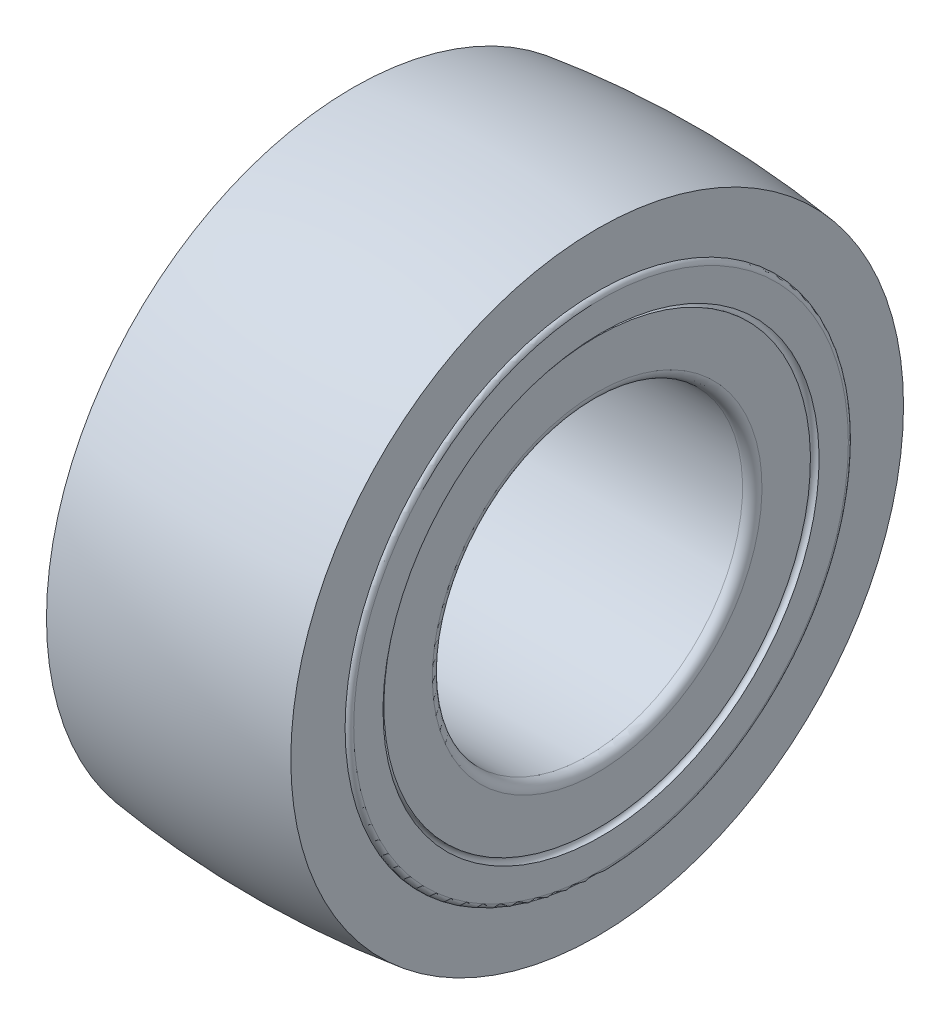
ISO-10303-21;
HEADER;
FILE_DESCRIPTION(('STEP AP214'),'2;1');
FILE_NAME('part.step','',(''),(''),'','','');
FILE_SCHEMA(('AUTOMOTIVE_DESIGN { 1 0 10303 214 1 1 1 1 }'));
ENDSEC;
DATA;
#1=APPLICATION_CONTEXT('core data for automotive mechanical design processes');
#2=APPLICATION_PROTOCOL_DEFINITION('international standard','automotive_design',2000,#1);
#3=PRODUCT_CONTEXT('',#1,'mechanical');
#4=PRODUCT('Part','Part','',(#3));
#5=PRODUCT_RELATED_PRODUCT_CATEGORY('part','',(#4));
#6=PRODUCT_DEFINITION_FORMATION('','',#4);
#7=PRODUCT_DEFINITION_CONTEXT('part definition',#1,'design');
#8=PRODUCT_DEFINITION('design','',#6,#7);
#9=PRODUCT_DEFINITION_SHAPE('','',#8);
#10=(LENGTH_UNIT() NAMED_UNIT(*) SI_UNIT(.MILLI.,.METRE.));
#11=(NAMED_UNIT(*) PLANE_ANGLE_UNIT() SI_UNIT($,.RADIAN.));
#12=(NAMED_UNIT(*) SI_UNIT($,.STERADIAN.) SOLID_ANGLE_UNIT());
#13=UNCERTAINTY_MEASURE_WITH_UNIT(LENGTH_MEASURE(1.E-05),#10,'distance_accuracy_value','');
#14=(GEOMETRIC_REPRESENTATION_CONTEXT(3) GLOBAL_UNCERTAINTY_ASSIGNED_CONTEXT((#13)) GLOBAL_UNIT_ASSIGNED_CONTEXT((#10,
#11,#12)) REPRESENTATION_CONTEXT('',''));
#15=CARTESIAN_POINT('',(0.,0.,0.));
#16=DIRECTION('',(0.,0.,1.));
#17=DIRECTION('',(1.,0.,0.));
#18=AXIS2_PLACEMENT_3D('',#15,#16,#17);
#19=CARTESIAN_POINT('',(-73.66,0.,0.));
#20=DIRECTION('',(1.,0.,0.));
#21=DIRECTION('',(0.,1.,0.));
#22=AXIS2_PLACEMENT_3D('',#19,#20,#21);
#23=TOROIDAL_SURFACE('',#22,107.95,6.35);
#24=CARTESIAN_POINT('',(-73.66,0.,0.));
#25=DIRECTION('',(1.,0.,0.));
#26=DIRECTION('',(0.,1.,0.));
#27=AXIS2_PLACEMENT_3D('',#24,#25,#26);
#28=CIRCLE('',#27,101.6);
#29=CARTESIAN_POINT('',(-73.66,101.6,0.));
#30=VERTEX_POINT('',#29);
#31=EDGE_CURVE('E8',#30,#30,#28,.T.);
#32=ORIENTED_EDGE('',*,*,#31,.T.);
#33=EDGE_LOOP('',(#32));
#34=FACE_BOUND('',#33,.T.);
#35=CARTESIAN_POINT('',(-80.01,0.,0.));
#36=DIRECTION('',(-1.,0.,0.));
#37=DIRECTION('',(0.,0.,1.));
#38=AXIS2_PLACEMENT_3D('',#35,#36,#37);
#39=CIRCLE('',#38,107.95);
#40=CARTESIAN_POINT('',(-80.01,0.,107.95));
#41=VERTEX_POINT('',#40);
#42=EDGE_CURVE('E21',#41,#41,#39,.T.);
#43=ORIENTED_EDGE('',*,*,#42,.T.);
#44=EDGE_LOOP('',(#43));
#45=FACE_BOUND('',#44,.T.);
#46=ADVANCED_FACE('F13',(#34,#45),#23,.T.);
#47=CARTESIAN_POINT('',(0.,0.,0.));
#48=DIRECTION('',(1.,0.,0.));
#49=DIRECTION('',(0.,1.,0.));
#50=AXIS2_PLACEMENT_3D('',#47,#48,#49);
#51=CYLINDRICAL_SURFACE('',#50,101.6);
#52=CARTESIAN_POINT('',(73.66,0.,0.));
#53=DIRECTION('',(-1.,0.,0.));
#54=DIRECTION('',(0.,0.,1.));
#55=AXIS2_PLACEMENT_3D('',#52,#53,#54);
#56=CIRCLE('',#55,101.6);
#57=CARTESIAN_POINT('',(73.66,0.,101.6));
#58=VERTEX_POINT('',#57);
#59=EDGE_CURVE('E29',#58,#58,#56,.T.);
#60=ORIENTED_EDGE('',*,*,#59,.F.);
#61=EDGE_LOOP('',(#60));
#62=FACE_BOUND('',#61,.T.);
#63=ORIENTED_EDGE('',*,*,#31,.F.);
#64=EDGE_LOOP('',(#63));
#65=FACE_BOUND('',#64,.T.);
#66=ADVANCED_FACE('F92',(#62,#65),#51,.F.);
#67=CARTESIAN_POINT('',(-80.01,151.13,0.));
#68=DIRECTION('',(-1.,0.,0.));
#69=DIRECTION('',(0.,0.,1.));
#70=AXIS2_PLACEMENT_3D('',#67,#68,#69);
#71=PLANE('',#70);
#72=CARTESIAN_POINT('',(-80.01,0.,0.));
#73=DIRECTION('',(-1.,0.,0.));
#74=DIRECTION('',(0.,0.,1.));
#75=AXIS2_PLACEMENT_3D('',#72,#73,#74);
#76=CIRCLE('',#75,139.7);
#77=CARTESIAN_POINT('',(-80.01,0.,139.7));
#78=VERTEX_POINT('',#77);
#79=EDGE_CURVE('E26',#78,#78,#76,.T.);
#80=ORIENTED_EDGE('',*,*,#79,.T.);
#81=EDGE_LOOP('',(#80));
#82=FACE_BOUND('',#81,.T.);
#83=ORIENTED_EDGE('',*,*,#42,.F.);
#84=EDGE_LOOP('',(#83));
#85=FACE_BOUND('',#84,.T.);
#86=ADVANCED_FACE('F97',(#82,#85),#71,.T.);
#87=CARTESIAN_POINT('',(73.66,0.,0.));
#88=DIRECTION('',(1.,0.,0.));
#89=DIRECTION('',(0.,1.,0.));
#90=AXIS2_PLACEMENT_3D('',#87,#88,#89);
#91=TOROIDAL_SURFACE('',#90,107.95,6.35);
#92=CARTESIAN_POINT('',(80.01,0.,0.));
#93=DIRECTION('',(1.,0.,0.));
#94=DIRECTION('',(0.,1.,0.));
#95=AXIS2_PLACEMENT_3D('',#92,#93,#94);
#96=CIRCLE('',#95,107.95);
#97=CARTESIAN_POINT('',(80.01,107.95,0.));
#98=VERTEX_POINT('',#97);
#99=EDGE_CURVE('E32',#98,#98,#96,.T.);
#100=ORIENTED_EDGE('',*,*,#99,.T.);
#101=EDGE_LOOP('',(#100));
#102=FACE_BOUND('',#101,.T.);
#103=ORIENTED_EDGE('',*,*,#59,.T.);
#104=EDGE_LOOP('',(#103));
#105=FACE_BOUND('',#104,.T.);
#106=ADVANCED_FACE('F103',(#102,#105),#91,.T.);
#107=CARTESIAN_POINT('',(80.01,151.13,0.));
#108=DIRECTION('',(1.,0.,0.));
#109=DIRECTION('',(0.,0.,-1.));
#110=AXIS2_PLACEMENT_3D('',#107,#108,#109);
#111=PLANE('',#110);
#112=CARTESIAN_POINT('',(80.01,0.,0.));
#113=DIRECTION('',(1.,0.,0.));
#114=DIRECTION('',(0.,1.,0.));
#115=AXIS2_PLACEMENT_3D('',#112,#113,#114);
#116=CIRCLE('',#115,139.7);
#117=CARTESIAN_POINT('',(80.01,139.7,0.));
#118=VERTEX_POINT('',#117);
#119=EDGE_CURVE('E33',#118,#118,#116,.T.);
#120=ORIENTED_EDGE('',*,*,#119,.T.);
#121=EDGE_LOOP('',(#120));
#122=FACE_BOUND('',#121,.T.);
#123=ORIENTED_EDGE('',*,*,#99,.F.);
#124=EDGE_LOOP('',(#123));
#125=FACE_BOUND('',#124,.T.);
#126=ADVANCED_FACE('F107',(#122,#125),#111,.T.);
#127=CARTESIAN_POINT('',(79.375,0.,0.));
#128=DIRECTION('',(1.,0.,0.));
#129=DIRECTION('',(0.,1.,0.));
#130=AXIS2_PLACEMENT_3D('',#127,#128,#129);
#131=TOROIDAL_SURFACE('',#130,161.989148026665,3.175);
#132=CARTESIAN_POINT('',(80.01,0.,0.));
#133=DIRECTION('',(-1.,0.,0.));
#134=DIRECTION('',(0.,0.,1.));
#135=AXIS2_PLACEMENT_3D('',#132,#133,#134);
#136=CIRCLE('',#135,165.1);
#137=CARTESIAN_POINT('',(80.01,0.,165.1));
#138=VERTEX_POINT('',#137);
#139=EDGE_CURVE('E41',#138,#138,#136,.T.);
#140=ORIENTED_EDGE('',*,*,#139,.F.);
#141=EDGE_LOOP('',(#140));
#142=FACE_BOUND('',#141,.T.);
#143=CARTESIAN_POINT('',(82.55,0.,0.));
#144=DIRECTION('',(-1.,0.,0.));
#145=DIRECTION('',(0.,0.,1.));
#146=AXIS2_PLACEMENT_3D('',#143,#144,#145);
#147=CIRCLE('',#146,161.989148026665);
#148=CARTESIAN_POINT('',(82.55,0.,161.989148026665));
#149=VERTEX_POINT('',#148);
#150=EDGE_CURVE('E40',#149,#149,#147,.T.);
#151=ORIENTED_EDGE('',*,*,#150,.T.);
#152=EDGE_LOOP('',(#151));
#153=FACE_BOUND('',#152,.T.);
#154=ADVANCED_FACE('F111',(#142,#153),#131,.T.);
#155=CARTESIAN_POINT('',(82.55,0.,0.));
#156=DIRECTION('',(-1.,0.,0.));
#157=DIRECTION('',(0.,0.,1.));
#158=AXIS2_PLACEMENT_3D('',#155,#156,#157);
#159=PLANE('',#158);
#160=CARTESIAN_POINT('',(82.55,0.,0.));
#161=DIRECTION('',(1.,0.,0.));
#162=DIRECTION('',(0.,1.,0.));
#163=AXIS2_PLACEMENT_3D('',#160,#161,#162);
#164=CIRCLE('',#163,142.810851973335);
#165=CARTESIAN_POINT('',(82.55,142.810851973335,0.));
#166=VERTEX_POINT('',#165);
#167=EDGE_CURVE('E48',#166,#166,#164,.T.);
#168=ORIENTED_EDGE('',*,*,#167,.F.);
#169=EDGE_LOOP('',(#168));
#170=FACE_BOUND('',#169,.T.);
#171=ORIENTED_EDGE('',*,*,#150,.F.);
#172=EDGE_LOOP('',(#171));
#173=FACE_BOUND('',#172,.T.);
#174=ADVANCED_FACE('F15',(#170,#173),#159,.F.);
#175=CARTESIAN_POINT('',(79.375,0.,0.));
#176=DIRECTION('',(1.,0.,0.));
#177=DIRECTION('',(0.,1.,0.));
#178=AXIS2_PLACEMENT_3D('',#175,#176,#177);
#179=TOROIDAL_SURFACE('',#178,142.810851973335,3.175);
#180=ORIENTED_EDGE('',*,*,#167,.T.);
#181=EDGE_LOOP('',(#180));
#182=FACE_BOUND('',#181,.T.);
#183=ORIENTED_EDGE('',*,*,#119,.F.);
#184=EDGE_LOOP('',(#183));
#185=FACE_BOUND('',#184,.T.);
#186=ADVANCED_FACE('F116',(#182,#185),#179,.F.);
#187=CARTESIAN_POINT('',(-79.375,0.,0.));
#188=DIRECTION('',(-1.,0.,0.));
#189=DIRECTION('',(0.,0.,1.));
#190=AXIS2_PLACEMENT_3D('',#187,#188,#189);
#191=TOROIDAL_SURFACE('',#190,142.810851973335,3.175);
#192=ORIENTED_EDGE('',*,*,#79,.F.);
#193=EDGE_LOOP('',(#192));
#194=FACE_BOUND('',#193,.T.);
#195=CARTESIAN_POINT('',(-82.55,0.,0.));
#196=DIRECTION('',(-1.,0.,0.));
#197=DIRECTION('',(0.,0.,1.));
#198=AXIS2_PLACEMENT_3D('',#195,#196,#197);
#199=CIRCLE('',#198,142.810851973335);
#200=CARTESIAN_POINT('',(-82.55,0.,142.810851973335));
#201=VERTEX_POINT('',#200);
#202=EDGE_CURVE('E51',#201,#201,#199,.T.);
#203=ORIENTED_EDGE('',*,*,#202,.T.);
#204=EDGE_LOOP('',(#203));
#205=FACE_BOUND('',#204,.T.);
#206=ADVANCED_FACE('F88',(#194,#205),#191,.T.);
#207=CARTESIAN_POINT('',(-82.55,0.,0.));
#208=DIRECTION('',(1.,0.,0.));
#209=DIRECTION('',(0.,0.,-1.));
#210=AXIS2_PLACEMENT_3D('',#207,#208,#209);
#211=PLANE('',#210);
#212=CARTESIAN_POINT('',(-82.55,0.,0.));
#213=DIRECTION('',(1.,0.,0.));
#214=DIRECTION('',(0.,1.,0.));
#215=AXIS2_PLACEMENT_3D('',#212,#213,#214);
#216=CIRCLE('',#215,161.989148026665);
#217=CARTESIAN_POINT('',(-82.55,161.989148026665,0.));
#218=VERTEX_POINT('',#217);
#219=EDGE_CURVE('E54',#218,#218,#216,.T.);
#220=ORIENTED_EDGE('',*,*,#219,.F.);
#221=EDGE_LOOP('',(#220));
#222=FACE_BOUND('',#221,.T.);
#223=ORIENTED_EDGE('',*,*,#202,.F.);
#224=EDGE_LOOP('',(#223));
#225=FACE_BOUND('',#224,.T.);
#226=ADVANCED_FACE('F79',(#222,#225),#211,.F.);
#227=CARTESIAN_POINT('',(-79.375,0.,0.));
#228=DIRECTION('',(-1.,0.,0.));
#229=DIRECTION('',(0.,0.,1.));
#230=AXIS2_PLACEMENT_3D('',#227,#228,#229);
#231=TOROIDAL_SURFACE('',#230,161.989148026665,3.175);
#232=ORIENTED_EDGE('',*,*,#219,.T.);
#233=EDGE_LOOP('',(#232));
#234=FACE_BOUND('',#233,.T.);
#235=CARTESIAN_POINT('',(-80.01,0.,0.));
#236=DIRECTION('',(1.,0.,0.));
#237=DIRECTION('',(0.,1.,0.));
#238=AXIS2_PLACEMENT_3D('',#235,#236,#237);
#239=CIRCLE('',#238,165.1);
#240=CARTESIAN_POINT('',(-80.01,165.1,0.));
#241=VERTEX_POINT('',#240);
#242=EDGE_CURVE('E45',#241,#241,#239,.T.);
#243=ORIENTED_EDGE('',*,*,#242,.F.);
#244=EDGE_LOOP('',(#243));
#245=FACE_BOUND('',#244,.T.);
#246=ADVANCED_FACE('F77',(#234,#245),#231,.T.);
#247=CARTESIAN_POINT('',(80.01,151.13,0.));
#248=DIRECTION('',(1.,0.,0.));
#249=DIRECTION('',(0.,0.,-1.));
#250=AXIS2_PLACEMENT_3D('',#247,#248,#249);
#251=PLANE('',#250);
#252=CARTESIAN_POINT('',(80.01,0.,0.));
#253=DIRECTION('',(1.,0.,0.));
#254=DIRECTION('',(0.,1.,0.));
#255=AXIS2_PLACEMENT_3D('',#252,#253,#254);
#256=CIRCLE('',#255,200.66);
#257=CARTESIAN_POINT('',(80.01,200.66,0.));
#258=VERTEX_POINT('',#257);
#259=EDGE_CURVE('E44',#258,#258,#256,.T.);
#260=ORIENTED_EDGE('',*,*,#259,.T.);
#261=EDGE_LOOP('',(#260));
#262=FACE_BOUND('',#261,.T.);
#263=ORIENTED_EDGE('',*,*,#139,.T.);
#264=EDGE_LOOP('',(#263));
#265=FACE_BOUND('',#264,.T.);
#266=ADVANCED_FACE('F61',(#262,#265),#251,.T.);
#267=CARTESIAN_POINT('',(-80.01,151.13,0.));
#268=DIRECTION('',(-1.,0.,0.));
#269=DIRECTION('',(0.,0.,1.));
#270=AXIS2_PLACEMENT_3D('',#267,#268,#269);
#271=PLANE('',#270);
#272=CARTESIAN_POINT('',(-80.01,0.,0.));
#273=DIRECTION('',(1.,0.,0.));
#274=DIRECTION('',(0.,1.,0.));
#275=AXIS2_PLACEMENT_3D('',#272,#273,#274);
#276=CIRCLE('',#275,200.66);
#277=CARTESIAN_POINT('',(-80.01,200.66,0.));
#278=VERTEX_POINT('',#277);
#279=EDGE_CURVE('E17',#278,#278,#276,.T.);
#280=ORIENTED_EDGE('',*,*,#279,.F.);
#281=EDGE_LOOP('',(#280));
#282=FACE_BOUND('',#281,.T.);
#283=ORIENTED_EDGE('',*,*,#242,.T.);
#284=EDGE_LOOP('',(#283));
#285=FACE_BOUND('',#284,.T.);
#286=ADVANCED_FACE('F67',(#282,#285),#271,.T.);
#287=CARTESIAN_POINT('',(0.,0.,0.));
#288=DIRECTION('',(1.,0.,0.));
#289=DIRECTION('',(0.,1.,0.));
#290=AXIS2_PLACEMENT_3D('',#287,#288,#289);
#291=DEGENERATE_TOROIDAL_SURFACE('',#290,426.878750000005,632.618750000005,.F.);
#292=ORIENTED_EDGE('',*,*,#259,.F.);
#293=EDGE_LOOP('',(#292));
#294=FACE_BOUND('',#293,.T.);
#295=ORIENTED_EDGE('',*,*,#279,.T.);
#296=EDGE_LOOP('',(#295));
#297=FACE_BOUND('',#296,.T.);
#298=ADVANCED_FACE('F64',(#294,#297),#291,.F.);
#299=CLOSED_SHELL('',(#46,#66,#86,#106,#126,#154,#174,#186,#206,#226,#246,#266,#286,#298));
#300=MANIFOLD_SOLID_BREP('B1',#299);
#301=ADVANCED_BREP_SHAPE_REPRESENTATION('',(#18,#300),#14);
#302=SHAPE_DEFINITION_REPRESENTATION(#9,#301);
ENDSEC;
END-ISO-10303-21;
